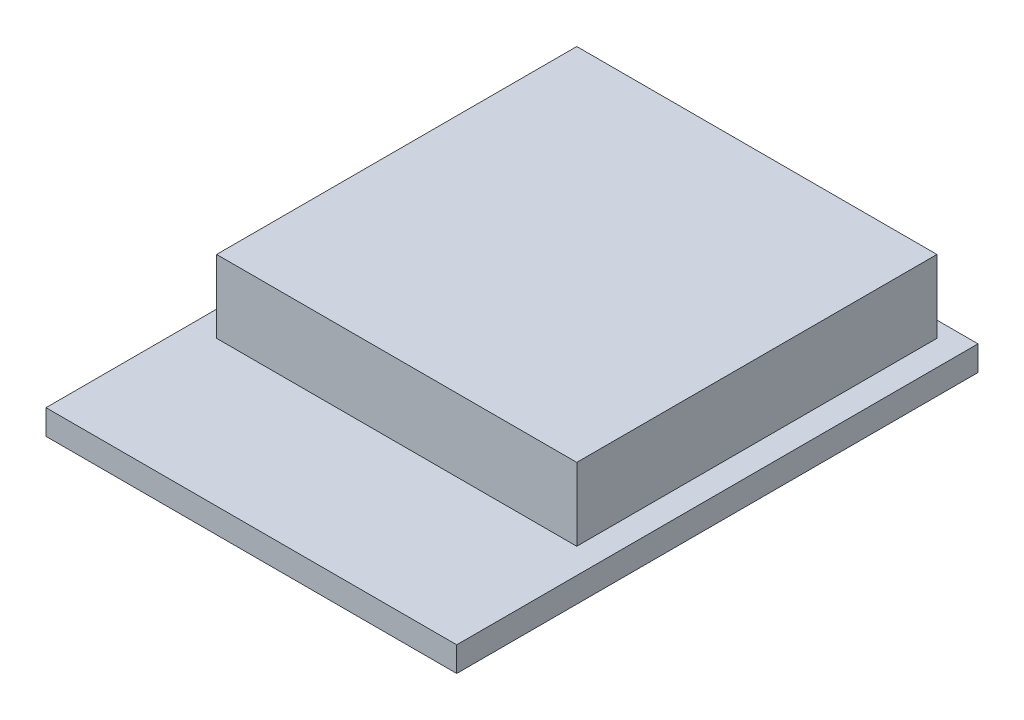
ISO-10303-21;
HEADER;
FILE_DESCRIPTION(('STEP AP214'),'2;1');
FILE_NAME('part.step','',(''),(''),'','','');
FILE_SCHEMA(('AUTOMOTIVE_DESIGN { 1 0 10303 214 1 1 1 1 }'));
ENDSEC;
DATA;
#1=APPLICATION_CONTEXT('core data for automotive mechanical design processes');
#2=APPLICATION_PROTOCOL_DEFINITION('international standard','automotive_design',2000,#1);
#3=PRODUCT_CONTEXT('',#1,'mechanical');
#4=PRODUCT('Part','Part','',(#3));
#5=PRODUCT_RELATED_PRODUCT_CATEGORY('part','',(#4));
#6=PRODUCT_DEFINITION_FORMATION('','',#4);
#7=PRODUCT_DEFINITION_CONTEXT('part definition',#1,'design');
#8=PRODUCT_DEFINITION('design','',#6,#7);
#9=PRODUCT_DEFINITION_SHAPE('','',#8);
#10=(LENGTH_UNIT() NAMED_UNIT(*) SI_UNIT(.MILLI.,.METRE.));
#11=(NAMED_UNIT(*) PLANE_ANGLE_UNIT() SI_UNIT($,.RADIAN.));
#12=(NAMED_UNIT(*) SI_UNIT($,.STERADIAN.) SOLID_ANGLE_UNIT());
#13=UNCERTAINTY_MEASURE_WITH_UNIT(LENGTH_MEASURE(1.E-05),#10,'distance_accuracy_value','');
#14=(GEOMETRIC_REPRESENTATION_CONTEXT(3) GLOBAL_UNCERTAINTY_ASSIGNED_CONTEXT((#13)) GLOBAL_UNIT_ASSIGNED_CONTEXT((#10,
#11,#12)) REPRESENTATION_CONTEXT('',''));
#15=CARTESIAN_POINT('',(0.,0.,0.));
#16=DIRECTION('',(0.,0.,1.));
#17=DIRECTION('',(1.,0.,0.));
#18=AXIS2_PLACEMENT_3D('',#15,#16,#17);
#19=CARTESIAN_POINT('',(0.,0.7874,0.));
#20=DIRECTION('',(0.,-1.,0.));
#21=DIRECTION('',(0.,0.,-1.));
#22=AXIS2_PLACEMENT_3D('',#19,#20,#21);
#23=PLANE('',#22);
#24=DIRECTION('',(0.,0.,1.));
#25=VECTOR('',#24,1.);
#26=CARTESIAN_POINT('',(-6.5,0.7874,-8.25));
#27=LINE('',#26,#25);
#28=CARTESIAN_POINT('',(-6.5,0.7874,-8.25));
#29=VERTEX_POINT('',#28);
#30=CARTESIAN_POINT('',(-6.5,0.7874,8.25));
#31=VERTEX_POINT('',#30);
#32=EDGE_CURVE('E128',#29,#31,#27,.T.);
#33=ORIENTED_EDGE('',*,*,#32,.T.);
#34=DIRECTION('',(1.,0.,0.));
#35=VECTOR('',#34,1.);
#36=CARTESIAN_POINT('',(6.5,0.7874,8.25));
#37=LINE('',#36,#35);
#38=CARTESIAN_POINT('',(6.5,0.7874,8.25));
#39=VERTEX_POINT('',#38);
#40=EDGE_CURVE('E131',#31,#39,#37,.T.);
#41=ORIENTED_EDGE('',*,*,#40,.T.);
#42=DIRECTION('',(0.,0.,-1.));
#43=VECTOR('',#42,1.);
#44=CARTESIAN_POINT('',(6.5,0.7874,-8.25));
#45=LINE('',#44,#43);
#46=CARTESIAN_POINT('',(6.5,0.7874,-8.25));
#47=VERTEX_POINT('',#46);
#48=EDGE_CURVE('E134',#39,#47,#45,.T.);
#49=ORIENTED_EDGE('',*,*,#48,.T.);
#50=DIRECTION('',(-1.,0.,0.));
#51=VECTOR('',#50,1.);
#52=CARTESIAN_POINT('',(6.5,0.7874,-8.25));
#53=LINE('',#52,#51);
#54=EDGE_CURVE('E136',#47,#29,#53,.T.);
#55=ORIENTED_EDGE('',*,*,#54,.T.);
#56=EDGE_LOOP('',(#33,#41,#49,#55));
#57=FACE_BOUND('',#56,.T.);
#58=DIRECTION('',(0.,0.,1.));
#59=VECTOR('',#58,1.);
#60=CARTESIAN_POINT('',(-5.7,0.7874,-7.75));
#61=LINE('',#60,#59);
#62=CARTESIAN_POINT('',(-5.7,0.7874,-7.75));
#63=VERTEX_POINT('',#62);
#64=CARTESIAN_POINT('',(-5.7,0.7874,3.65));
#65=VERTEX_POINT('',#64);
#66=EDGE_CURVE('E118',#63,#65,#61,.T.);
#67=ORIENTED_EDGE('',*,*,#66,.F.);
#68=DIRECTION('',(-1.,0.,0.));
#69=VECTOR('',#68,1.);
#70=CARTESIAN_POINT('',(5.7,0.7874,-7.75));
#71=LINE('',#70,#69);
#72=CARTESIAN_POINT('',(5.7,0.7874,-7.75));
#73=VERTEX_POINT('',#72);
#74=EDGE_CURVE('E115',#73,#63,#71,.T.);
#75=ORIENTED_EDGE('',*,*,#74,.F.);
#76=DIRECTION('',(0.,0.,-1.));
#77=VECTOR('',#76,1.);
#78=CARTESIAN_POINT('',(5.7,0.7874,-7.75));
#79=LINE('',#78,#77);
#80=CARTESIAN_POINT('',(5.7,0.7874,3.65));
#81=VERTEX_POINT('',#80);
#82=EDGE_CURVE('E53',#81,#73,#79,.T.);
#83=ORIENTED_EDGE('',*,*,#82,.F.);
#84=DIRECTION('',(1.,0.,0.));
#85=VECTOR('',#84,1.);
#86=CARTESIAN_POINT('',(5.7,0.7874,3.65));
#87=LINE('',#86,#85);
#88=EDGE_CURVE('E48',#65,#81,#87,.T.);
#89=ORIENTED_EDGE('',*,*,#88,.F.);
#90=EDGE_LOOP('',(#67,#75,#83,#89));
#91=FACE_BOUND('',#90,.T.);
#92=ADVANCED_FACE('F33',(#57,#91),#23,.F.);
#93=CARTESIAN_POINT('',(-6.5,0.7874,-8.25));
#94=DIRECTION('',(1.,0.,0.));
#95=DIRECTION('',(0.,0.,-1.));
#96=AXIS2_PLACEMENT_3D('',#93,#94,#95);
#97=PLANE('',#96);
#98=DIRECTION('',(0.,0.,1.));
#99=VECTOR('',#98,1.);
#100=CARTESIAN_POINT('',(-6.5,0.,-8.25));
#101=LINE('',#100,#99);
#102=CARTESIAN_POINT('',(-6.5,0.,-8.25));
#103=VERTEX_POINT('',#102);
#104=CARTESIAN_POINT('',(-6.5,0.,8.25));
#105=VERTEX_POINT('',#104);
#106=EDGE_CURVE('E119',#103,#105,#101,.T.);
#107=ORIENTED_EDGE('',*,*,#106,.T.);
#108=DIRECTION('',(0.,-1.,0.));
#109=VECTOR('',#108,1.);
#110=CARTESIAN_POINT('',(-6.5,0.7874,8.25));
#111=LINE('',#110,#109);
#112=EDGE_CURVE('E11',#31,#105,#111,.T.);
#113=ORIENTED_EDGE('',*,*,#112,.F.);
#114=ORIENTED_EDGE('',*,*,#32,.F.);
#115=DIRECTION('',(0.,-1.,0.));
#116=VECTOR('',#115,1.);
#117=CARTESIAN_POINT('',(-6.5,0.7874,-8.25));
#118=LINE('',#117,#116);
#119=EDGE_CURVE('E137',#29,#103,#118,.T.);
#120=ORIENTED_EDGE('',*,*,#119,.T.);
#121=EDGE_LOOP('',(#107,#113,#114,#120));
#122=FACE_BOUND('',#121,.T.);
#123=ADVANCED_FACE('F35',(#122),#97,.F.);
#124=CARTESIAN_POINT('',(6.5,0.7874,8.25));
#125=DIRECTION('',(0.,0.,-1.));
#126=DIRECTION('',(-1.,0.,0.));
#127=AXIS2_PLACEMENT_3D('',#124,#125,#126);
#128=PLANE('',#127);
#129=DIRECTION('',(1.,0.,0.));
#130=VECTOR('',#129,1.);
#131=CARTESIAN_POINT('',(6.5,0.,8.25));
#132=LINE('',#131,#130);
#133=CARTESIAN_POINT('',(6.5,0.,8.25));
#134=VERTEX_POINT('',#133);
#135=EDGE_CURVE('E122',#105,#134,#132,.T.);
#136=ORIENTED_EDGE('',*,*,#135,.T.);
#137=DIRECTION('',(0.,-1.,0.));
#138=VECTOR('',#137,1.);
#139=CARTESIAN_POINT('',(6.5,0.7874,8.25));
#140=LINE('',#139,#138);
#141=EDGE_CURVE('E41',#39,#134,#140,.T.);
#142=ORIENTED_EDGE('',*,*,#141,.F.);
#143=ORIENTED_EDGE('',*,*,#40,.F.);
#144=ORIENTED_EDGE('',*,*,#112,.T.);
#145=EDGE_LOOP('',(#136,#142,#143,#144));
#146=FACE_BOUND('',#145,.T.);
#147=ADVANCED_FACE('F167',(#146),#128,.F.);
#148=CARTESIAN_POINT('',(6.5,0.7874,-8.25));
#149=DIRECTION('',(-1.,0.,0.));
#150=DIRECTION('',(0.,0.,1.));
#151=AXIS2_PLACEMENT_3D('',#148,#149,#150);
#152=PLANE('',#151);
#153=DIRECTION('',(0.,0.,-1.));
#154=VECTOR('',#153,1.);
#155=CARTESIAN_POINT('',(6.5,0.,-8.25));
#156=LINE('',#155,#154);
#157=CARTESIAN_POINT('',(6.5,0.,-8.25));
#158=VERTEX_POINT('',#157);
#159=EDGE_CURVE('E140',#134,#158,#156,.T.);
#160=ORIENTED_EDGE('',*,*,#159,.T.);
#161=DIRECTION('',(0.,-1.,0.));
#162=VECTOR('',#161,1.);
#163=CARTESIAN_POINT('',(6.5,0.7874,-8.25));
#164=LINE('',#163,#162);
#165=EDGE_CURVE('E145',#47,#158,#164,.T.);
#166=ORIENTED_EDGE('',*,*,#165,.F.);
#167=ORIENTED_EDGE('',*,*,#48,.F.);
#168=ORIENTED_EDGE('',*,*,#141,.T.);
#169=EDGE_LOOP('',(#160,#166,#167,#168));
#170=FACE_BOUND('',#169,.T.);
#171=ADVANCED_FACE('F152',(#170),#152,.F.);
#172=CARTESIAN_POINT('',(6.5,0.7874,-8.25));
#173=DIRECTION('',(0.,0.,1.));
#174=DIRECTION('',(1.,0.,0.));
#175=AXIS2_PLACEMENT_3D('',#172,#173,#174);
#176=PLANE('',#175);
#177=DIRECTION('',(-1.,0.,0.));
#178=VECTOR('',#177,1.);
#179=CARTESIAN_POINT('',(6.5,0.,-8.25));
#180=LINE('',#179,#178);
#181=EDGE_CURVE('E132',#158,#103,#180,.T.);
#182=ORIENTED_EDGE('',*,*,#181,.T.);
#183=ORIENTED_EDGE('',*,*,#119,.F.);
#184=ORIENTED_EDGE('',*,*,#54,.F.);
#185=ORIENTED_EDGE('',*,*,#165,.T.);
#186=EDGE_LOOP('',(#182,#183,#184,#185));
#187=FACE_BOUND('',#186,.T.);
#188=ADVANCED_FACE('F161',(#187),#176,.F.);
#189=CARTESIAN_POINT('',(0.,0.,0.));
#190=DIRECTION('',(0.,-1.,0.));
#191=DIRECTION('',(0.,0.,-1.));
#192=AXIS2_PLACEMENT_3D('',#189,#190,#191);
#193=PLANE('',#192);
#194=ORIENTED_EDGE('',*,*,#106,.F.);
#195=ORIENTED_EDGE('',*,*,#181,.F.);
#196=ORIENTED_EDGE('',*,*,#159,.F.);
#197=ORIENTED_EDGE('',*,*,#135,.F.);
#198=EDGE_LOOP('',(#194,#195,#196,#197));
#199=FACE_BOUND('',#198,.T.);
#200=ADVANCED_FACE('F158',(#199),#193,.T.);
#201=CARTESIAN_POINT('',(-5.7,3.0874,-7.75));
#202=DIRECTION('',(1.,0.,0.));
#203=DIRECTION('',(0.,0.,-1.));
#204=AXIS2_PLACEMENT_3D('',#201,#202,#203);
#205=PLANE('',#204);
#206=ORIENTED_EDGE('',*,*,#66,.T.);
#207=DIRECTION('',(0.,-1.,0.));
#208=VECTOR('',#207,1.);
#209=CARTESIAN_POINT('',(-5.7,3.0874,3.65));
#210=LINE('',#209,#208);
#211=CARTESIAN_POINT('',(-5.7,3.0874,3.65));
#212=VERTEX_POINT('',#211);
#213=EDGE_CURVE('E99',#212,#65,#210,.T.);
#214=ORIENTED_EDGE('',*,*,#213,.F.);
#215=DIRECTION('',(0.,0.,1.));
#216=VECTOR('',#215,1.);
#217=CARTESIAN_POINT('',(-5.7,3.0874,-7.75));
#218=LINE('',#217,#216);
#219=CARTESIAN_POINT('',(-5.7,3.0874,-7.75));
#220=VERTEX_POINT('',#219);
#221=EDGE_CURVE('E106',#220,#212,#218,.T.);
#222=ORIENTED_EDGE('',*,*,#221,.F.);
#223=DIRECTION('',(0.,-1.,0.));
#224=VECTOR('',#223,1.);
#225=CARTESIAN_POINT('',(-5.7,3.0874,-7.75));
#226=LINE('',#225,#224);
#227=EDGE_CURVE('E260',#220,#63,#226,.T.);
#228=ORIENTED_EDGE('',*,*,#227,.T.);
#229=EDGE_LOOP('',(#206,#214,#222,#228));
#230=FACE_BOUND('',#229,.T.);
#231=ADVANCED_FACE('F117',(#230),#205,.F.);
#232=CARTESIAN_POINT('',(5.7,3.0874,3.65));
#233=DIRECTION('',(0.,0.,-1.));
#234=DIRECTION('',(-1.,0.,0.));
#235=AXIS2_PLACEMENT_3D('',#232,#233,#234);
#236=PLANE('',#235);
#237=ORIENTED_EDGE('',*,*,#88,.T.);
#238=DIRECTION('',(0.,-1.,0.));
#239=VECTOR('',#238,1.);
#240=CARTESIAN_POINT('',(5.7,3.0874,3.65));
#241=LINE('',#240,#239);
#242=CARTESIAN_POINT('',(5.7,3.0874,3.65));
#243=VERTEX_POINT('',#242);
#244=EDGE_CURVE('E102',#243,#81,#241,.T.);
#245=ORIENTED_EDGE('',*,*,#244,.F.);
#246=DIRECTION('',(1.,0.,0.));
#247=VECTOR('',#246,1.);
#248=CARTESIAN_POINT('',(5.7,3.0874,3.65));
#249=LINE('',#248,#247);
#250=EDGE_CURVE('E95',#212,#243,#249,.T.);
#251=ORIENTED_EDGE('',*,*,#250,.F.);
#252=ORIENTED_EDGE('',*,*,#213,.T.);
#253=EDGE_LOOP('',(#237,#245,#251,#252));
#254=FACE_BOUND('',#253,.T.);
#255=ADVANCED_FACE('F97',(#254),#236,.F.);
#256=CARTESIAN_POINT('',(5.7,3.0874,-7.75));
#257=DIRECTION('',(-1.,0.,0.));
#258=DIRECTION('',(0.,0.,1.));
#259=AXIS2_PLACEMENT_3D('',#256,#257,#258);
#260=PLANE('',#259);
#261=ORIENTED_EDGE('',*,*,#82,.T.);
#262=DIRECTION('',(0.,-1.,0.));
#263=VECTOR('',#262,1.);
#264=CARTESIAN_POINT('',(5.7,3.0874,-7.75));
#265=LINE('',#264,#263);
#266=CARTESIAN_POINT('',(5.7,3.0874,-7.75));
#267=VERTEX_POINT('',#266);
#268=EDGE_CURVE('E124',#267,#73,#265,.T.);
#269=ORIENTED_EDGE('',*,*,#268,.F.);
#270=DIRECTION('',(0.,0.,-1.));
#271=VECTOR('',#270,1.);
#272=CARTESIAN_POINT('',(5.7,3.0874,-7.75));
#273=LINE('',#272,#271);
#274=EDGE_CURVE('E105',#243,#267,#273,.T.);
#275=ORIENTED_EDGE('',*,*,#274,.F.);
#276=ORIENTED_EDGE('',*,*,#244,.T.);
#277=EDGE_LOOP('',(#261,#269,#275,#276));
#278=FACE_BOUND('',#277,.T.);
#279=ADVANCED_FACE('F203',(#278),#260,.F.);
#280=CARTESIAN_POINT('',(5.7,3.0874,-7.75));
#281=DIRECTION('',(0.,0.,1.));
#282=DIRECTION('',(1.,0.,0.));
#283=AXIS2_PLACEMENT_3D('',#280,#281,#282);
#284=PLANE('',#283);
#285=ORIENTED_EDGE('',*,*,#74,.T.);
#286=ORIENTED_EDGE('',*,*,#227,.F.);
#287=DIRECTION('',(-1.,0.,0.));
#288=VECTOR('',#287,1.);
#289=CARTESIAN_POINT('',(5.7,3.0874,-7.75));
#290=LINE('',#289,#288);
#291=EDGE_CURVE('E111',#267,#220,#290,.T.);
#292=ORIENTED_EDGE('',*,*,#291,.F.);
#293=ORIENTED_EDGE('',*,*,#268,.T.);
#294=EDGE_LOOP('',(#285,#286,#292,#293));
#295=FACE_BOUND('',#294,.T.);
#296=ADVANCED_FACE('F209',(#295),#284,.F.);
#297=CARTESIAN_POINT('',(0.,3.0874,0.));
#298=DIRECTION('',(0.,-1.,0.));
#299=DIRECTION('',(0.,0.,-1.));
#300=AXIS2_PLACEMENT_3D('',#297,#298,#299);
#301=PLANE('',#300);
#302=ORIENTED_EDGE('',*,*,#221,.T.);
#303=ORIENTED_EDGE('',*,*,#250,.T.);
#304=ORIENTED_EDGE('',*,*,#274,.T.);
#305=ORIENTED_EDGE('',*,*,#291,.T.);
#306=EDGE_LOOP('',(#302,#303,#304,#305));
#307=FACE_BOUND('',#306,.T.);
#308=ADVANCED_FACE('F109',(#307),#301,.F.);
#309=CLOSED_SHELL('',(#92,#123,#147,#171,#188,#200,#231,#255,#279,#296,#308));
#310=MANIFOLD_SOLID_BREP('B2',#309);
#311=ADVANCED_BREP_SHAPE_REPRESENTATION('',(#18,#310),#14);
#312=SHAPE_DEFINITION_REPRESENTATION(#9,#311);
ENDSEC;
END-ISO-10303-21;
